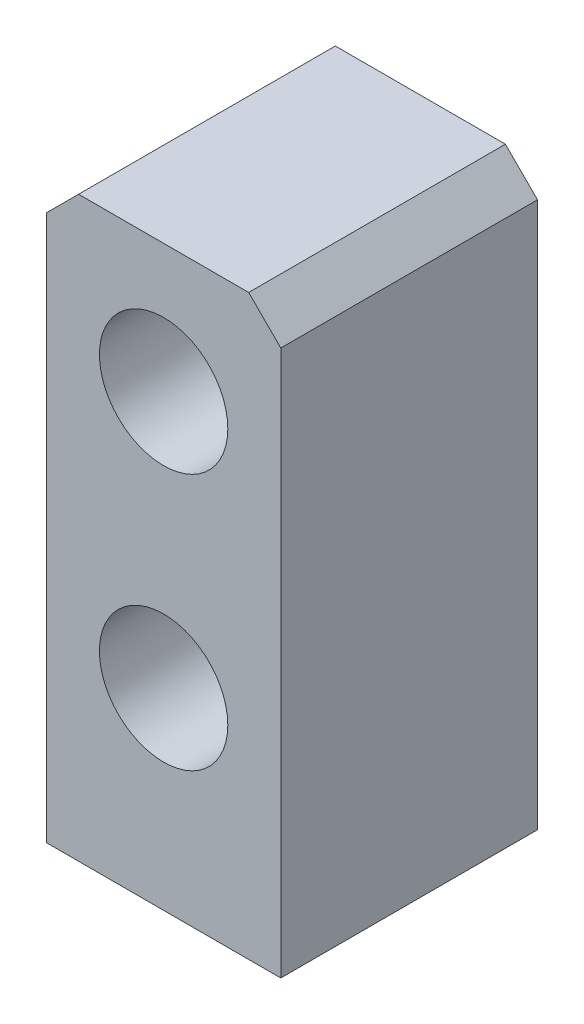
ISO-10303-21;
HEADER;
FILE_DESCRIPTION(('STEP AP214'),'2;1');
FILE_NAME('part.step','',(''),(''),'','','');
FILE_SCHEMA(('AUTOMOTIVE_DESIGN { 1 0 10303 214 1 1 1 1 }'));
ENDSEC;
DATA;
#1=APPLICATION_CONTEXT('core data for automotive mechanical design processes');
#2=APPLICATION_PROTOCOL_DEFINITION('international standard','automotive_design',2000,#1);
#3=PRODUCT_CONTEXT('',#1,'mechanical');
#4=PRODUCT('Part','Part','',(#3));
#5=PRODUCT_RELATED_PRODUCT_CATEGORY('part','',(#4));
#6=PRODUCT_DEFINITION_FORMATION('','',#4);
#7=PRODUCT_DEFINITION_CONTEXT('part definition',#1,'design');
#8=PRODUCT_DEFINITION('design','',#6,#7);
#9=PRODUCT_DEFINITION_SHAPE('','',#8);
#10=(LENGTH_UNIT() NAMED_UNIT(*) SI_UNIT(.MILLI.,.METRE.));
#11=(NAMED_UNIT(*) PLANE_ANGLE_UNIT() SI_UNIT($,.RADIAN.));
#12=(NAMED_UNIT(*) SI_UNIT($,.STERADIAN.) SOLID_ANGLE_UNIT());
#13=UNCERTAINTY_MEASURE_WITH_UNIT(LENGTH_MEASURE(1.E-05),#10,'distance_accuracy_value','');
#14=(GEOMETRIC_REPRESENTATION_CONTEXT(3) GLOBAL_UNCERTAINTY_ASSIGNED_CONTEXT((#13)) GLOBAL_UNIT_ASSIGNED_CONTEXT((#10,
#11,#12)) REPRESENTATION_CONTEXT('',''));
#15=CARTESIAN_POINT('',(0.,0.,0.));
#16=DIRECTION('',(0.,0.,1.));
#17=DIRECTION('',(1.,0.,0.));
#18=AXIS2_PLACEMENT_3D('',#15,#16,#17);
#19=CARTESIAN_POINT('',(-18.25,-45.,40.));
#20=DIRECTION('',(1.,0.,0.));
#21=DIRECTION('',(0.,0.,-1.));
#22=AXIS2_PLACEMENT_3D('',#19,#20,#21);
#23=PLANE('',#22);
#24=DIRECTION('',(0.,-1.,0.));
#25=VECTOR('',#24,1.);
#26=CARTESIAN_POINT('',(-18.25,-45.,0.));
#27=LINE('',#26,#25);
#28=CARTESIAN_POINT('',(-18.25,40.,0.));
#29=VERTEX_POINT('',#28);
#30=CARTESIAN_POINT('',(-18.25,-45.,0.));
#31=VERTEX_POINT('',#30);
#32=EDGE_CURVE('E117',#29,#31,#27,.T.);
#33=ORIENTED_EDGE('',*,*,#32,.T.);
#34=DIRECTION('',(0.,0.,-1.));
#35=VECTOR('',#34,1.);
#36=CARTESIAN_POINT('',(-18.25,-45.,40.));
#37=LINE('',#36,#35);
#38=CARTESIAN_POINT('',(-18.25,-45.,40.));
#39=VERTEX_POINT('',#38);
#40=EDGE_CURVE('E11',#39,#31,#37,.T.);
#41=ORIENTED_EDGE('',*,*,#40,.F.);
#42=DIRECTION('',(0.,-1.,0.));
#43=VECTOR('',#42,1.);
#44=CARTESIAN_POINT('',(-18.25,-45.,40.));
#45=LINE('',#44,#43);
#46=CARTESIAN_POINT('',(-18.25,40.,40.));
#47=VERTEX_POINT('',#46);
#48=EDGE_CURVE('E128',#47,#39,#45,.T.);
#49=ORIENTED_EDGE('',*,*,#48,.F.);
#50=DIRECTION('',(0.,0.,-1.));
#51=VECTOR('',#50,1.);
#52=CARTESIAN_POINT('',(-18.25,40.,40.));
#53=LINE('',#52,#51);
#54=EDGE_CURVE('E113',#47,#29,#53,.T.);
#55=ORIENTED_EDGE('',*,*,#54,.T.);
#56=EDGE_LOOP('',(#33,#41,#49,#55));
#57=FACE_BOUND('',#56,.T.);
#58=ADVANCED_FACE('F33',(#57),#23,.F.);
#59=CARTESIAN_POINT('',(-18.25,-45.,40.));
#60=DIRECTION('',(0.,1.,0.));
#61=DIRECTION('',(0.,0.,1.));
#62=AXIS2_PLACEMENT_3D('',#59,#60,#61);
#63=PLANE('',#62);
#64=DIRECTION('',(1.,0.,0.));
#65=VECTOR('',#64,1.);
#66=CARTESIAN_POINT('',(-18.25,-45.,0.));
#67=LINE('',#66,#65);
#68=CARTESIAN_POINT('',(18.25,-45.,0.));
#69=VERTEX_POINT('',#68);
#70=EDGE_CURVE('E120',#31,#69,#67,.T.);
#71=ORIENTED_EDGE('',*,*,#70,.T.);
#72=DIRECTION('',(0.,0.,-1.));
#73=VECTOR('',#72,1.);
#74=CARTESIAN_POINT('',(18.25,-45.,40.));
#75=LINE('',#74,#73);
#76=CARTESIAN_POINT('',(18.25,-45.,40.));
#77=VERTEX_POINT('',#76);
#78=EDGE_CURVE('E41',#77,#69,#75,.T.);
#79=ORIENTED_EDGE('',*,*,#78,.F.);
#80=DIRECTION('',(1.,0.,0.));
#81=VECTOR('',#80,1.);
#82=CARTESIAN_POINT('',(-18.25,-45.,40.));
#83=LINE('',#82,#81);
#84=EDGE_CURVE('E86',#39,#77,#83,.T.);
#85=ORIENTED_EDGE('',*,*,#84,.F.);
#86=ORIENTED_EDGE('',*,*,#40,.T.);
#87=EDGE_LOOP('',(#71,#79,#85,#86));
#88=FACE_BOUND('',#87,.T.);
#89=ADVANCED_FACE('F153',(#88),#63,.F.);
#90=CARTESIAN_POINT('',(18.25,-45.,40.));
#91=DIRECTION('',(-1.,0.,0.));
#92=DIRECTION('',(0.,0.,1.));
#93=AXIS2_PLACEMENT_3D('',#90,#91,#92);
#94=PLANE('',#93);
#95=DIRECTION('',(0.,1.,0.));
#96=VECTOR('',#95,1.);
#97=CARTESIAN_POINT('',(18.25,-45.,0.));
#98=LINE('',#97,#96);
#99=CARTESIAN_POINT('',(18.25,40.,0.));
#100=VERTEX_POINT('',#99);
#101=EDGE_CURVE('E123',#69,#100,#98,.T.);
#102=ORIENTED_EDGE('',*,*,#101,.T.);
#103=DIRECTION('',(0.,0.,-1.));
#104=VECTOR('',#103,1.);
#105=CARTESIAN_POINT('',(18.25,40.,40.));
#106=LINE('',#105,#104);
#107=CARTESIAN_POINT('',(18.25,40.,40.));
#108=VERTEX_POINT('',#107);
#109=EDGE_CURVE('E108',#108,#100,#106,.T.);
#110=ORIENTED_EDGE('',*,*,#109,.F.);
#111=DIRECTION('',(0.,1.,0.));
#112=VECTOR('',#111,1.);
#113=CARTESIAN_POINT('',(18.25,-45.,40.));
#114=LINE('',#113,#112);
#115=EDGE_CURVE('E99',#77,#108,#114,.T.);
#116=ORIENTED_EDGE('',*,*,#115,.F.);
#117=ORIENTED_EDGE('',*,*,#78,.T.);
#118=EDGE_LOOP('',(#102,#110,#116,#117));
#119=FACE_BOUND('',#118,.T.);
#120=ADVANCED_FACE('F134',(#119),#94,.F.);
#121=CARTESIAN_POINT('',(13.25,45.,40.));
#122=DIRECTION('',(-0.707106781186547,-0.707106781186548,0.));
#123=DIRECTION('',(0.707106781186548,-0.707106781186547,0.));
#124=AXIS2_PLACEMENT_3D('',#121,#122,#123);
#125=PLANE('',#124);
#126=DIRECTION('',(-0.707106781186548,0.707106781186547,0.));
#127=VECTOR('',#126,1.);
#128=CARTESIAN_POINT('',(13.25,45.,0.));
#129=LINE('',#128,#127);
#130=CARTESIAN_POINT('',(13.25,45.,0.));
#131=VERTEX_POINT('',#130);
#132=EDGE_CURVE('E107',#100,#131,#129,.T.);
#133=ORIENTED_EDGE('',*,*,#132,.T.);
#134=DIRECTION('',(0.,0.,-1.));
#135=VECTOR('',#134,1.);
#136=CARTESIAN_POINT('',(13.25,45.,40.));
#137=LINE('',#136,#135);
#138=CARTESIAN_POINT('',(13.25,45.,40.));
#139=VERTEX_POINT('',#138);
#140=EDGE_CURVE('E104',#139,#131,#137,.T.);
#141=ORIENTED_EDGE('',*,*,#140,.F.);
#142=DIRECTION('',(-0.707106781186548,0.707106781186547,0.));
#143=VECTOR('',#142,1.);
#144=CARTESIAN_POINT('',(13.25,45.,40.));
#145=LINE('',#144,#143);
#146=EDGE_CURVE('E93',#108,#139,#145,.T.);
#147=ORIENTED_EDGE('',*,*,#146,.F.);
#148=ORIENTED_EDGE('',*,*,#109,.T.);
#149=EDGE_LOOP('',(#133,#141,#147,#148));
#150=FACE_BOUND('',#149,.T.);
#151=ADVANCED_FACE('F105',(#150),#125,.F.);
#152=CARTESIAN_POINT('',(-13.25,45.,40.));
#153=DIRECTION('',(0.,-1.,0.));
#154=DIRECTION('',(0.,0.,-1.));
#155=AXIS2_PLACEMENT_3D('',#152,#153,#154);
#156=PLANE('',#155);
#157=DIRECTION('',(-1.,0.,0.));
#158=VECTOR('',#157,1.);
#159=CARTESIAN_POINT('',(-13.25,45.,0.));
#160=LINE('',#159,#158);
#161=CARTESIAN_POINT('',(-13.25,45.,0.));
#162=VERTEX_POINT('',#161);
#163=EDGE_CURVE('E72',#131,#162,#160,.T.);
#164=ORIENTED_EDGE('',*,*,#163,.T.);
#165=DIRECTION('',(0.,0.,-1.));
#166=VECTOR('',#165,1.);
#167=CARTESIAN_POINT('',(-13.25,45.,40.));
#168=LINE('',#167,#166);
#169=CARTESIAN_POINT('',(-13.25,45.,40.));
#170=VERTEX_POINT('',#169);
#171=EDGE_CURVE('E109',#170,#162,#168,.T.);
#172=ORIENTED_EDGE('',*,*,#171,.F.);
#173=DIRECTION('',(-1.,0.,0.));
#174=VECTOR('',#173,1.);
#175=CARTESIAN_POINT('',(-13.25,45.,40.));
#176=LINE('',#175,#174);
#177=EDGE_CURVE('E97',#139,#170,#176,.T.);
#178=ORIENTED_EDGE('',*,*,#177,.F.);
#179=ORIENTED_EDGE('',*,*,#140,.T.);
#180=EDGE_LOOP('',(#164,#172,#178,#179));
#181=FACE_BOUND('',#180,.T.);
#182=ADVANCED_FACE('F111',(#181),#156,.F.);
#183=CARTESIAN_POINT('',(-18.25,40.,40.));
#184=DIRECTION('',(0.707106781186547,-0.707106781186548,0.));
#185=DIRECTION('',(0.707106781186548,0.707106781186547,0.));
#186=AXIS2_PLACEMENT_3D('',#183,#184,#185);
#187=PLANE('',#186);
#188=DIRECTION('',(-0.707106781186548,-0.707106781186547,0.));
#189=VECTOR('',#188,1.);
#190=CARTESIAN_POINT('',(-18.25,40.,0.));
#191=LINE('',#190,#189);
#192=EDGE_CURVE('E78',#162,#29,#191,.T.);
#193=ORIENTED_EDGE('',*,*,#192,.T.);
#194=ORIENTED_EDGE('',*,*,#54,.F.);
#195=DIRECTION('',(-0.707106781186548,-0.707106781186547,0.));
#196=VECTOR('',#195,1.);
#197=CARTESIAN_POINT('',(-18.25,40.,40.));
#198=LINE('',#197,#196);
#199=EDGE_CURVE('E49',#170,#47,#198,.T.);
#200=ORIENTED_EDGE('',*,*,#199,.F.);
#201=ORIENTED_EDGE('',*,*,#171,.T.);
#202=EDGE_LOOP('',(#193,#194,#200,#201));
#203=FACE_BOUND('',#202,.T.);
#204=ADVANCED_FACE('F141',(#203),#187,.F.);
#205=CARTESIAN_POINT('',(0.,0.,40.));
#206=DIRECTION('',(0.,0.,-1.));
#207=DIRECTION('',(-1.,0.,0.));
#208=AXIS2_PLACEMENT_3D('',#205,#206,#207);
#209=PLANE('',#208);
#210=CARTESIAN_POINT('',(0.,-15.,40.));
#211=DIRECTION('',(0.,0.,1.));
#212=DIRECTION('',(1.,0.,0.));
#213=AXIS2_PLACEMENT_3D('',#210,#211,#212);
#214=CIRCLE('',#213,10.);
#215=CARTESIAN_POINT('',(10.,-15.,40.));
#216=VERTEX_POINT('',#215);
#217=EDGE_CURVE('E219',#216,#216,#214,.T.);
#218=ORIENTED_EDGE('',*,*,#217,.F.);
#219=EDGE_LOOP('',(#218));
#220=FACE_BOUND('',#219,.T.);
#221=CARTESIAN_POINT('',(0.,25.,40.));
#222=DIRECTION('',(0.,0.,1.));
#223=DIRECTION('',(1.,0.,0.));
#224=AXIS2_PLACEMENT_3D('',#221,#222,#223);
#225=CIRCLE('',#224,10.);
#226=CARTESIAN_POINT('',(10.,25.,40.));
#227=VERTEX_POINT('',#226);
#228=EDGE_CURVE('E221',#227,#227,#225,.T.);
#229=ORIENTED_EDGE('',*,*,#228,.F.);
#230=EDGE_LOOP('',(#229));
#231=FACE_BOUND('',#230,.T.);
#232=ORIENTED_EDGE('',*,*,#48,.T.);
#233=ORIENTED_EDGE('',*,*,#84,.T.);
#234=ORIENTED_EDGE('',*,*,#115,.T.);
#235=ORIENTED_EDGE('',*,*,#146,.T.);
#236=ORIENTED_EDGE('',*,*,#177,.T.);
#237=ORIENTED_EDGE('',*,*,#199,.T.);
#238=EDGE_LOOP('',(#232,#233,#234,#235,#236,#237));
#239=FACE_BOUND('',#238,.T.);
#240=ADVANCED_FACE('F95',(#220,#231,#239),#209,.F.);
#241=CARTESIAN_POINT('',(0.,0.,0.));
#242=DIRECTION('',(0.,0.,-1.));
#243=DIRECTION('',(-1.,0.,0.));
#244=AXIS2_PLACEMENT_3D('',#241,#242,#243);
#245=PLANE('',#244);
#246=CARTESIAN_POINT('',(0.,-15.,0.));
#247=DIRECTION('',(0.,0.,1.));
#248=DIRECTION('',(1.,0.,0.));
#249=AXIS2_PLACEMENT_3D('',#246,#247,#248);
#250=CIRCLE('',#249,10.);
#251=CARTESIAN_POINT('',(10.,-15.,0.));
#252=VERTEX_POINT('',#251);
#253=EDGE_CURVE('E216',#252,#252,#250,.T.);
#254=ORIENTED_EDGE('',*,*,#253,.T.);
#255=EDGE_LOOP('',(#254));
#256=FACE_BOUND('',#255,.T.);
#257=CARTESIAN_POINT('',(0.,25.,0.));
#258=DIRECTION('',(0.,0.,1.));
#259=DIRECTION('',(1.,0.,0.));
#260=AXIS2_PLACEMENT_3D('',#257,#258,#259);
#261=CIRCLE('',#260,10.);
#262=CARTESIAN_POINT('',(10.,25.,0.));
#263=VERTEX_POINT('',#262);
#264=EDGE_CURVE('E121',#263,#263,#261,.T.);
#265=ORIENTED_EDGE('',*,*,#264,.T.);
#266=EDGE_LOOP('',(#265));
#267=FACE_BOUND('',#266,.T.);
#268=ORIENTED_EDGE('',*,*,#32,.F.);
#269=ORIENTED_EDGE('',*,*,#192,.F.);
#270=ORIENTED_EDGE('',*,*,#163,.F.);
#271=ORIENTED_EDGE('',*,*,#132,.F.);
#272=ORIENTED_EDGE('',*,*,#101,.F.);
#273=ORIENTED_EDGE('',*,*,#70,.F.);
#274=EDGE_LOOP('',(#268,#269,#270,#271,#272,#273));
#275=FACE_BOUND('',#274,.T.);
#276=ADVANCED_FACE('F137',(#256,#267,#275),#245,.T.);
#277=CARTESIAN_POINT('',(0.,25.,0.));
#278=DIRECTION('',(0.,0.,1.));
#279=DIRECTION('',(1.,0.,0.));
#280=AXIS2_PLACEMENT_3D('',#277,#278,#279);
#281=CYLINDRICAL_SURFACE('',#280,10.);
#282=ORIENTED_EDGE('',*,*,#264,.F.);
#283=EDGE_LOOP('',(#282));
#284=FACE_BOUND('',#283,.T.);
#285=ORIENTED_EDGE('',*,*,#228,.T.);
#286=EDGE_LOOP('',(#285));
#287=FACE_BOUND('',#286,.T.);
#288=ADVANCED_FACE('F190',(#284,#287),#281,.F.);
#289=CARTESIAN_POINT('',(0.,-15.,0.));
#290=DIRECTION('',(0.,0.,1.));
#291=DIRECTION('',(1.,0.,0.));
#292=AXIS2_PLACEMENT_3D('',#289,#290,#291);
#293=CYLINDRICAL_SURFACE('',#292,10.);
#294=ORIENTED_EDGE('',*,*,#253,.F.);
#295=EDGE_LOOP('',(#294));
#296=FACE_BOUND('',#295,.T.);
#297=ORIENTED_EDGE('',*,*,#217,.T.);
#298=EDGE_LOOP('',(#297));
#299=FACE_BOUND('',#298,.T.);
#300=ADVANCED_FACE('F199',(#296,#299),#293,.F.);
#301=CLOSED_SHELL('',(#58,#89,#120,#151,#182,#204,#240,#276,#288,#300));
#302=MANIFOLD_SOLID_BREP('B2',#301);
#303=ADVANCED_BREP_SHAPE_REPRESENTATION('',(#18,#302),#14);
#304=SHAPE_DEFINITION_REPRESENTATION(#9,#303);
ENDSEC;
END-ISO-10303-21;
